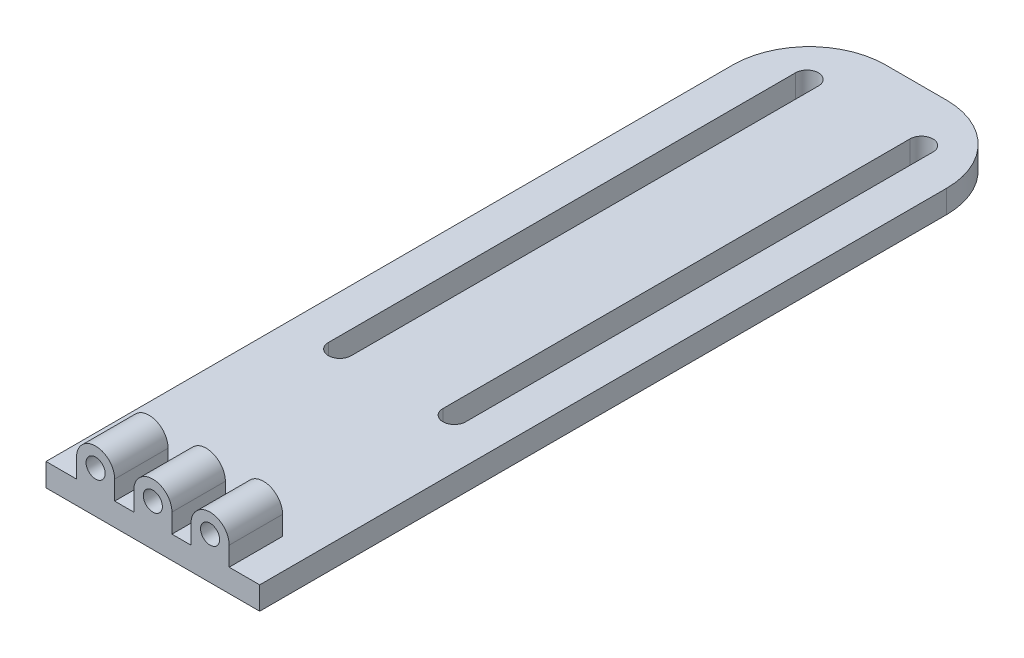
ISO-10303-21;
HEADER;
FILE_DESCRIPTION(('STEP AP214'),'2;1');
FILE_NAME('part.step','',(''),(''),'','','');
FILE_SCHEMA(('AUTOMOTIVE_DESIGN { 1 0 10303 214 1 1 1 1 }'));
ENDSEC;
DATA;
#1=APPLICATION_CONTEXT('core data for automotive mechanical design processes');
#2=APPLICATION_PROTOCOL_DEFINITION('international standard','automotive_design',2000,#1);
#3=PRODUCT_CONTEXT('',#1,'mechanical');
#4=PRODUCT('Part','Part','',(#3));
#5=PRODUCT_RELATED_PRODUCT_CATEGORY('part','',(#4));
#6=PRODUCT_DEFINITION_FORMATION('','',#4);
#7=PRODUCT_DEFINITION_CONTEXT('part definition',#1,'design');
#8=PRODUCT_DEFINITION('design','',#6,#7);
#9=PRODUCT_DEFINITION_SHAPE('','',#8);
#10=(LENGTH_UNIT() NAMED_UNIT(*) SI_UNIT(.MILLI.,.METRE.));
#11=(NAMED_UNIT(*) PLANE_ANGLE_UNIT() SI_UNIT($,.RADIAN.));
#12=(NAMED_UNIT(*) SI_UNIT($,.STERADIAN.) SOLID_ANGLE_UNIT());
#13=UNCERTAINTY_MEASURE_WITH_UNIT(LENGTH_MEASURE(1.E-05),#10,'distance_accuracy_value','');
#14=(GEOMETRIC_REPRESENTATION_CONTEXT(3) GLOBAL_UNCERTAINTY_ASSIGNED_CONTEXT((#13)) GLOBAL_UNIT_ASSIGNED_CONTEXT((#10,
#11,#12)) REPRESENTATION_CONTEXT('',''));
#15=CARTESIAN_POINT('',(0.,0.,0.));
#16=DIRECTION('',(0.,0.,1.));
#17=DIRECTION('',(1.,0.,0.));
#18=AXIS2_PLACEMENT_3D('',#15,#16,#17);
#19=CARTESIAN_POINT('',(-14.,3.,0.));
#20=DIRECTION('',(0.,0.,-1.));
#21=DIRECTION('',(-1.,0.,0.));
#22=AXIS2_PLACEMENT_3D('',#19,#20,#21);
#23=PLANE('',#22);
#24=CARTESIAN_POINT('',(-7.5,5.5,0.));
#25=DIRECTION('',(0.,0.,1.));
#26=DIRECTION('',(1.,0.,0.));
#27=AXIS2_PLACEMENT_3D('',#24,#25,#26);
#28=CIRCLE('',#27,1.25);
#29=CARTESIAN_POINT('',(-6.25,5.5,0.));
#30=VERTEX_POINT('',#29);
#31=EDGE_CURVE('E352',#30,#30,#28,.T.);
#32=ORIENTED_EDGE('',*,*,#31,.F.);
#33=EDGE_LOOP('',(#32));
#34=FACE_BOUND('',#33,.T.);
#35=CARTESIAN_POINT('',(0.,5.5,0.));
#36=DIRECTION('',(0.,0.,1.));
#37=DIRECTION('',(1.,0.,0.));
#38=AXIS2_PLACEMENT_3D('',#35,#36,#37);
#39=CIRCLE('',#38,1.25);
#40=CARTESIAN_POINT('',(1.25,5.5,0.));
#41=VERTEX_POINT('',#40);
#42=EDGE_CURVE('E360',#41,#41,#39,.T.);
#43=ORIENTED_EDGE('',*,*,#42,.F.);
#44=EDGE_LOOP('',(#43));
#45=FACE_BOUND('',#44,.T.);
#46=CARTESIAN_POINT('',(7.5,5.5,0.));
#47=DIRECTION('',(0.,0.,1.));
#48=DIRECTION('',(1.,0.,0.));
#49=AXIS2_PLACEMENT_3D('',#46,#47,#48);
#50=CIRCLE('',#49,1.25);
#51=CARTESIAN_POINT('',(8.75,5.5,0.));
#52=VERTEX_POINT('',#51);
#53=EDGE_CURVE('E330',#52,#52,#50,.T.);
#54=ORIENTED_EDGE('',*,*,#53,.F.);
#55=EDGE_LOOP('',(#54));
#56=FACE_BOUND('',#55,.T.);
#57=CARTESIAN_POINT('',(-7.5,5.5,0.));
#58=DIRECTION('',(0.,0.,-1.));
#59=DIRECTION('',(1.,0.,0.));
#60=AXIS2_PLACEMENT_3D('',#57,#58,#59);
#61=CIRCLE('',#60,2.5);
#62=CARTESIAN_POINT('',(-10.,5.5,0.));
#63=VERTEX_POINT('',#62);
#64=CARTESIAN_POINT('',(-5.,5.5,0.));
#65=VERTEX_POINT('',#64);
#66=EDGE_CURVE('E313',#63,#65,#61,.T.);
#67=ORIENTED_EDGE('',*,*,#66,.F.);
#68=DIRECTION('',(0.,1.,0.));
#69=VECTOR('',#68,1.);
#70=CARTESIAN_POINT('',(-10.,5.5,0.));
#71=LINE('',#70,#69);
#72=CARTESIAN_POINT('',(-10.,3.,0.));
#73=VERTEX_POINT('',#72);
#74=EDGE_CURVE('E268',#73,#63,#71,.T.);
#75=ORIENTED_EDGE('',*,*,#74,.F.);
#76=DIRECTION('',(1.,0.,0.));
#77=VECTOR('',#76,1.);
#78=CARTESIAN_POINT('',(-10.,3.,0.));
#79=LINE('',#78,#77);
#80=CARTESIAN_POINT('',(-14.,3.,0.));
#81=VERTEX_POINT('',#80);
#82=EDGE_CURVE('E264',#81,#73,#79,.T.);
#83=ORIENTED_EDGE('',*,*,#82,.F.);
#84=DIRECTION('',(0.,-1.,0.));
#85=VECTOR('',#84,1.);
#86=CARTESIAN_POINT('',(-14.,3.,0.));
#87=LINE('',#86,#85);
#88=CARTESIAN_POINT('',(-14.,0.,0.));
#89=VERTEX_POINT('',#88);
#90=EDGE_CURVE('E391',#81,#89,#87,.T.);
#91=ORIENTED_EDGE('',*,*,#90,.T.);
#92=DIRECTION('',(1.,0.,0.));
#93=VECTOR('',#92,1.);
#94=CARTESIAN_POINT('',(-14.,0.,0.));
#95=LINE('',#94,#93);
#96=CARTESIAN_POINT('',(14.,0.,0.));
#97=VERTEX_POINT('',#96);
#98=EDGE_CURVE('E377',#89,#97,#95,.T.);
#99=ORIENTED_EDGE('',*,*,#98,.T.);
#100=DIRECTION('',(0.,-1.,0.));
#101=VECTOR('',#100,1.);
#102=CARTESIAN_POINT('',(14.,3.,0.));
#103=LINE('',#102,#101);
#104=CARTESIAN_POINT('',(14.,3.,0.));
#105=VERTEX_POINT('',#104);
#106=EDGE_CURVE('E381',#105,#97,#103,.T.);
#107=ORIENTED_EDGE('',*,*,#106,.F.);
#108=DIRECTION('',(1.,0.,0.));
#109=VECTOR('',#108,1.);
#110=CARTESIAN_POINT('',(14.,3.,0.));
#111=LINE('',#110,#109);
#112=CARTESIAN_POINT('',(10.,3.,0.));
#113=VERTEX_POINT('',#112);
#114=EDGE_CURVE('E338',#113,#105,#111,.T.);
#115=ORIENTED_EDGE('',*,*,#114,.F.);
#116=DIRECTION('',(0.,-1.,0.));
#117=VECTOR('',#116,1.);
#118=CARTESIAN_POINT('',(10.,3.,0.));
#119=LINE('',#118,#117);
#120=CARTESIAN_POINT('',(10.,5.5,0.));
#121=VERTEX_POINT('',#120);
#122=EDGE_CURVE('E342',#121,#113,#119,.T.);
#123=ORIENTED_EDGE('',*,*,#122,.F.);
#124=CARTESIAN_POINT('',(7.5,5.5,0.));
#125=DIRECTION('',(0.,0.,-1.));
#126=DIRECTION('',(1.,0.,0.));
#127=AXIS2_PLACEMENT_3D('',#124,#125,#126);
#128=CIRCLE('',#127,2.5);
#129=CARTESIAN_POINT('',(5.,5.5,0.));
#130=VERTEX_POINT('',#129);
#131=EDGE_CURVE('E345',#130,#121,#128,.T.);
#132=ORIENTED_EDGE('',*,*,#131,.F.);
#133=DIRECTION('',(0.,1.,0.));
#134=VECTOR('',#133,1.);
#135=CARTESIAN_POINT('',(5.,5.5,0.));
#136=LINE('',#135,#134);
#137=CARTESIAN_POINT('',(5.,3.,0.));
#138=VERTEX_POINT('',#137);
#139=EDGE_CURVE('E280',#138,#130,#136,.T.);
#140=ORIENTED_EDGE('',*,*,#139,.F.);
#141=DIRECTION('',(1.,0.,0.));
#142=VECTOR('',#141,1.);
#143=CARTESIAN_POINT('',(5.,3.,0.));
#144=LINE('',#143,#142);
#145=CARTESIAN_POINT('',(2.5,3.,0.));
#146=VERTEX_POINT('',#145);
#147=EDGE_CURVE('E290',#146,#138,#144,.T.);
#148=ORIENTED_EDGE('',*,*,#147,.F.);
#149=DIRECTION('',(0.,-1.,0.));
#150=VECTOR('',#149,1.);
#151=CARTESIAN_POINT('',(2.5,3.,0.));
#152=LINE('',#151,#150);
#153=CARTESIAN_POINT('',(2.5,5.5,0.));
#154=VERTEX_POINT('',#153);
#155=EDGE_CURVE('E293',#154,#146,#152,.T.);
#156=ORIENTED_EDGE('',*,*,#155,.F.);
#157=CARTESIAN_POINT('',(0.,5.5,0.));
#158=DIRECTION('',(0.,0.,-1.));
#159=DIRECTION('',(1.,0.,0.));
#160=AXIS2_PLACEMENT_3D('',#157,#158,#159);
#161=CIRCLE('',#160,2.5);
#162=CARTESIAN_POINT('',(-2.5,5.5,0.));
#163=VERTEX_POINT('',#162);
#164=EDGE_CURVE('E325',#163,#154,#161,.T.);
#165=ORIENTED_EDGE('',*,*,#164,.F.);
#166=DIRECTION('',(0.,1.,0.));
#167=VECTOR('',#166,1.);
#168=CARTESIAN_POINT('',(-2.5,5.5,0.));
#169=LINE('',#168,#167);
#170=CARTESIAN_POINT('',(-2.5,3.,0.));
#171=VERTEX_POINT('',#170);
#172=EDGE_CURVE('E322',#171,#163,#169,.T.);
#173=ORIENTED_EDGE('',*,*,#172,.F.);
#174=DIRECTION('',(1.,0.,0.));
#175=VECTOR('',#174,1.);
#176=CARTESIAN_POINT('',(-5.,3.,0.));
#177=LINE('',#176,#175);
#178=CARTESIAN_POINT('',(-5.,3.,0.));
#179=VERTEX_POINT('',#178);
#180=EDGE_CURVE('E319',#179,#171,#177,.T.);
#181=ORIENTED_EDGE('',*,*,#180,.F.);
#182=DIRECTION('',(0.,-1.,0.));
#183=VECTOR('',#182,1.);
#184=CARTESIAN_POINT('',(-5.,3.,0.));
#185=LINE('',#184,#183);
#186=EDGE_CURVE('E316',#65,#179,#185,.T.);
#187=ORIENTED_EDGE('',*,*,#186,.F.);
#188=EDGE_LOOP('',(#67,#75,#83,#91,#99,#107,#115,#123,#132,#140,#148,#156,#165,#173,#181,#187));
#189=FACE_BOUND('',#188,.T.);
#190=ADVANCED_FACE('F32',(#34,#45,#56,#189),#23,.F.);
#191=CARTESIAN_POINT('',(-14.,8.,-7.));
#192=DIRECTION('',(0.,0.,1.));
#193=DIRECTION('',(1.,0.,0.));
#194=AXIS2_PLACEMENT_3D('',#191,#192,#193);
#195=PLANE('',#194);
#196=CARTESIAN_POINT('',(0.,5.5,-7.00000000000001));
#197=DIRECTION('',(0.,0.,1.));
#198=DIRECTION('',(1.,0.,0.));
#199=AXIS2_PLACEMENT_3D('',#196,#197,#198);
#200=CIRCLE('',#199,1.25);
#201=CARTESIAN_POINT('',(1.25,5.5,-7.00000000000001));
#202=VERTEX_POINT('',#201);
#203=EDGE_CURVE('E356',#202,#202,#200,.F.);
#204=ORIENTED_EDGE('',*,*,#203,.F.);
#205=EDGE_LOOP('',(#204));
#206=FACE_BOUND('',#205,.T.);
#207=CARTESIAN_POINT('',(0.,5.5,-7.00000000000001));
#208=DIRECTION('',(0.,0.,1.));
#209=DIRECTION('',(1.,0.,0.));
#210=AXIS2_PLACEMENT_3D('',#207,#208,#209);
#211=CIRCLE('',#210,2.5);
#212=CARTESIAN_POINT('',(2.5,5.5,-7.00000000000001));
#213=VERTEX_POINT('',#212);
#214=CARTESIAN_POINT('',(-2.5,5.5,-7.00000000000001));
#215=VERTEX_POINT('',#214);
#216=EDGE_CURVE('E310',#213,#215,#211,.T.);
#217=ORIENTED_EDGE('',*,*,#216,.F.);
#218=DIRECTION('',(0.,1.,0.));
#219=VECTOR('',#218,1.);
#220=CARTESIAN_POINT('',(2.5,3.,-7.00000000000001));
#221=LINE('',#220,#219);
#222=CARTESIAN_POINT('',(2.5,3.,-7.00000000000001));
#223=VERTEX_POINT('',#222);
#224=EDGE_CURVE('E296',#223,#213,#221,.T.);
#225=ORIENTED_EDGE('',*,*,#224,.F.);
#226=DIRECTION('',(-1.,0.,0.));
#227=VECTOR('',#226,1.);
#228=CARTESIAN_POINT('',(-14.,3.,-7.));
#229=LINE('',#228,#227);
#230=CARTESIAN_POINT('',(-2.5,3.,-7.00000000000001));
#231=VERTEX_POINT('',#230);
#232=EDGE_CURVE('E372',#223,#231,#229,.T.);
#233=ORIENTED_EDGE('',*,*,#232,.T.);
#234=DIRECTION('',(0.,-1.,0.));
#235=VECTOR('',#234,1.);
#236=CARTESIAN_POINT('',(-2.5,5.5,-7.00000000000001));
#237=LINE('',#236,#235);
#238=EDGE_CURVE('E307',#215,#231,#237,.T.);
#239=ORIENTED_EDGE('',*,*,#238,.F.);
#240=EDGE_LOOP('',(#217,#225,#233,#239));
#241=FACE_BOUND('',#240,.T.);
#242=ADVANCED_FACE('F469',(#206,#241),#195,.F.);
#243=CARTESIAN_POINT('',(7.5,5.5,-7.00000000000001));
#244=DIRECTION('',(0.,0.,1.));
#245=DIRECTION('',(1.,0.,0.));
#246=AXIS2_PLACEMENT_3D('',#243,#244,#245);
#247=CIRCLE('',#246,1.25);
#248=CARTESIAN_POINT('',(8.75,5.5,-7.00000000000001));
#249=VERTEX_POINT('',#248);
#250=EDGE_CURVE('E363',#249,#249,#247,.F.);
#251=ORIENTED_EDGE('',*,*,#250,.F.);
#252=EDGE_LOOP('',(#251));
#253=FACE_BOUND('',#252,.T.);
#254=CARTESIAN_POINT('',(10.,3.,-7.00000000000001));
#255=VERTEX_POINT('',#254);
#256=CARTESIAN_POINT('',(5.,3.,-7.00000000000001));
#257=VERTEX_POINT('',#256);
#258=EDGE_CURVE('E373',#255,#257,#229,.T.);
#259=ORIENTED_EDGE('',*,*,#258,.T.);
#260=DIRECTION('',(0.,-1.,0.));
#261=VECTOR('',#260,1.);
#262=CARTESIAN_POINT('',(5.,5.5,-7.00000000000001));
#263=LINE('',#262,#261);
#264=CARTESIAN_POINT('',(5.,5.5,-7.00000000000001));
#265=VERTEX_POINT('',#264);
#266=EDGE_CURVE('E271',#265,#257,#263,.T.);
#267=ORIENTED_EDGE('',*,*,#266,.F.);
#268=CARTESIAN_POINT('',(7.5,5.5,-7.00000000000001));
#269=DIRECTION('',(0.,0.,1.));
#270=DIRECTION('',(1.,0.,0.));
#271=AXIS2_PLACEMENT_3D('',#268,#269,#270);
#272=CIRCLE('',#271,2.5);
#273=CARTESIAN_POINT('',(10.,5.5,-7.00000000000001));
#274=VERTEX_POINT('',#273);
#275=EDGE_CURVE('E348',#274,#265,#272,.T.);
#276=ORIENTED_EDGE('',*,*,#275,.F.);
#277=DIRECTION('',(0.,1.,0.));
#278=VECTOR('',#277,1.);
#279=CARTESIAN_POINT('',(10.,3.,-7.00000000000001));
#280=LINE('',#279,#278);
#281=EDGE_CURVE('E287',#255,#274,#280,.T.);
#282=ORIENTED_EDGE('',*,*,#281,.F.);
#283=EDGE_LOOP('',(#259,#267,#276,#282));
#284=FACE_BOUND('',#283,.T.);
#285=ADVANCED_FACE('F477',(#253,#284),#195,.F.);
#286=CARTESIAN_POINT('',(-7.5,5.5,-7.00000000000001));
#287=DIRECTION('',(0.,0.,1.));
#288=DIRECTION('',(1.,0.,0.));
#289=AXIS2_PLACEMENT_3D('',#286,#287,#288);
#290=CIRCLE('',#289,1.25);
#291=CARTESIAN_POINT('',(-6.25,5.5,-7.00000000000001));
#292=VERTEX_POINT('',#291);
#293=EDGE_CURVE('E355',#292,#292,#290,.F.);
#294=ORIENTED_EDGE('',*,*,#293,.F.);
#295=EDGE_LOOP('',(#294));
#296=FACE_BOUND('',#295,.T.);
#297=DIRECTION('',(0.,-1.,0.));
#298=VECTOR('',#297,1.);
#299=CARTESIAN_POINT('',(-10.,5.5,-7.00000000000001));
#300=LINE('',#299,#298);
#301=CARTESIAN_POINT('',(-10.,5.5,-7.00000000000001));
#302=VERTEX_POINT('',#301);
#303=CARTESIAN_POINT('',(-10.,3.,-7.00000000000001));
#304=VERTEX_POINT('',#303);
#305=EDGE_CURVE('E239',#302,#304,#300,.T.);
#306=ORIENTED_EDGE('',*,*,#305,.F.);
#307=CARTESIAN_POINT('',(-7.5,5.5,-7.00000000000001));
#308=DIRECTION('',(0.,0.,1.));
#309=DIRECTION('',(1.,0.,0.));
#310=AXIS2_PLACEMENT_3D('',#307,#308,#309);
#311=CIRCLE('',#310,2.5);
#312=CARTESIAN_POINT('',(-5.,5.5,-7.00000000000001));
#313=VERTEX_POINT('',#312);
#314=EDGE_CURVE('E301',#313,#302,#311,.T.);
#315=ORIENTED_EDGE('',*,*,#314,.F.);
#316=DIRECTION('',(0.,1.,0.));
#317=VECTOR('',#316,1.);
#318=CARTESIAN_POINT('',(-5.,3.,-7.00000000000001));
#319=LINE('',#318,#317);
#320=CARTESIAN_POINT('',(-5.,3.,-7.00000000000001));
#321=VERTEX_POINT('',#320);
#322=EDGE_CURVE('E303',#321,#313,#319,.T.);
#323=ORIENTED_EDGE('',*,*,#322,.F.);
#324=EDGE_CURVE('E359',#321,#304,#229,.T.);
#325=ORIENTED_EDGE('',*,*,#324,.T.);
#326=EDGE_LOOP('',(#306,#315,#323,#325));
#327=FACE_BOUND('',#326,.T.);
#328=ADVANCED_FACE('F455',(#296,#327),#195,.F.);
#329=CARTESIAN_POINT('',(0.,3.,0.));
#330=DIRECTION('',(0.,-1.,0.));
#331=DIRECTION('',(0.,0.,-1.));
#332=AXIS2_PLACEMENT_3D('',#329,#330,#331);
#333=PLANE('',#332);
#334=DIRECTION('',(0.,0.,-1.));
#335=VECTOR('',#334,1.);
#336=CARTESIAN_POINT('',(-5.99999999999999,3.,-32.0000000000107));
#337=LINE('',#336,#335);
#338=CARTESIAN_POINT('',(-5.99999999999999,3.,-32.0000000000107));
#339=VERTEX_POINT('',#338);
#340=CARTESIAN_POINT('',(-5.99999999999999,3.,-93.208471880839));
#341=VERTEX_POINT('',#340);
#342=EDGE_CURVE('E222',#339,#341,#337,.T.);
#343=ORIENTED_EDGE('',*,*,#342,.F.);
#344=CARTESIAN_POINT('',(-7.49999999999999,3.,-32.0000000000107));
#345=DIRECTION('',(0.,1.,0.));
#346=DIRECTION('',(0.,0.,1.));
#347=AXIS2_PLACEMENT_3D('',#344,#345,#346);
#348=CIRCLE('',#347,1.5);
#349=CARTESIAN_POINT('',(-8.99999999999999,3.,-32.0000000000107));
#350=VERTEX_POINT('',#349);
#351=EDGE_CURVE('E227',#350,#339,#348,.T.);
#352=ORIENTED_EDGE('',*,*,#351,.F.);
#353=DIRECTION('',(0.,0.,1.));
#354=VECTOR('',#353,1.);
#355=CARTESIAN_POINT('',(-8.99999999999999,3.,-32.0000000000107));
#356=LINE('',#355,#354);
#357=CARTESIAN_POINT('',(-8.99999999999999,3.,-93.208471880839));
#358=VERTEX_POINT('',#357);
#359=EDGE_CURVE('E232',#358,#350,#356,.T.);
#360=ORIENTED_EDGE('',*,*,#359,.F.);
#361=CARTESIAN_POINT('',(-7.49999999999999,3.,-93.208471880839));
#362=DIRECTION('',(0.,1.,0.));
#363=DIRECTION('',(0.,0.,1.));
#364=AXIS2_PLACEMENT_3D('',#361,#362,#363);
#365=CIRCLE('',#364,1.5);
#366=EDGE_CURVE('E211',#341,#358,#365,.T.);
#367=ORIENTED_EDGE('',*,*,#366,.F.);
#368=EDGE_LOOP('',(#343,#352,#360,#367));
#369=FACE_BOUND('',#368,.T.);
#370=DIRECTION('',(0.,0.,-1.));
#371=VECTOR('',#370,1.);
#372=CARTESIAN_POINT('',(8.99999999999999,3.,-32.0000000000107));
#373=LINE('',#372,#371);
#374=CARTESIAN_POINT('',(8.99999999999999,3.,-32.0000000000107));
#375=VERTEX_POINT('',#374);
#376=CARTESIAN_POINT('',(8.99999999999999,3.,-93.208471880839));
#377=VERTEX_POINT('',#376);
#378=EDGE_CURVE('E244',#375,#377,#373,.T.);
#379=ORIENTED_EDGE('',*,*,#378,.F.);
#380=CARTESIAN_POINT('',(7.49999999999999,3.,-32.0000000000107));
#381=DIRECTION('',(0.,1.,0.));
#382=DIRECTION('',(0.,0.,-1.));
#383=AXIS2_PLACEMENT_3D('',#380,#381,#382);
#384=CIRCLE('',#383,1.5);
#385=CARTESIAN_POINT('',(5.99999999999999,3.,-32.0000000000107));
#386=VERTEX_POINT('',#385);
#387=EDGE_CURVE('E242',#386,#375,#384,.T.);
#388=ORIENTED_EDGE('',*,*,#387,.F.);
#389=DIRECTION('',(0.,0.,1.));
#390=VECTOR('',#389,1.);
#391=CARTESIAN_POINT('',(5.99999999999999,3.,-32.0000000000107));
#392=LINE('',#391,#390);
#393=CARTESIAN_POINT('',(5.99999999999999,3.,-93.208471880839));
#394=VERTEX_POINT('',#393);
#395=EDGE_CURVE('E250',#394,#386,#392,.T.);
#396=ORIENTED_EDGE('',*,*,#395,.F.);
#397=CARTESIAN_POINT('',(7.49999999999999,3.,-93.208471880839));
#398=DIRECTION('',(0.,1.,0.));
#399=DIRECTION('',(0.,0.,-1.));
#400=AXIS2_PLACEMENT_3D('',#397,#398,#399);
#401=CIRCLE('',#400,1.5);
#402=EDGE_CURVE('E247',#377,#394,#401,.T.);
#403=ORIENTED_EDGE('',*,*,#402,.F.);
#404=EDGE_LOOP('',(#379,#388,#396,#403));
#405=FACE_BOUND('',#404,.T.);
#406=DIRECTION('',(-1.,0.,0.));
#407=VECTOR('',#406,1.);
#408=CARTESIAN_POINT('',(-14.,3.,-100.));
#409=LINE('',#408,#407);
#410=CARTESIAN_POINT('',(4.,3.,-100.));
#411=VERTEX_POINT('',#410);
#412=CARTESIAN_POINT('',(-4.,3.,-100.));
#413=VERTEX_POINT('',#412);
#414=EDGE_CURVE('E376',#411,#413,#409,.T.);
#415=ORIENTED_EDGE('',*,*,#414,.T.);
#416=CARTESIAN_POINT('',(-4.,3.,-90.));
#417=DIRECTION('',(0.,-1.,0.));
#418=DIRECTION('',(0.,0.,-1.));
#419=AXIS2_PLACEMENT_3D('',#416,#417,#418);
#420=CIRCLE('',#419,10.);
#421=CARTESIAN_POINT('',(-14.,3.,-90.));
#422=VERTEX_POINT('',#421);
#423=EDGE_CURVE('E40',#413,#422,#420,.F.);
#424=ORIENTED_EDGE('',*,*,#423,.T.);
#425=DIRECTION('',(0.,0.,1.));
#426=VECTOR('',#425,1.);
#427=CARTESIAN_POINT('',(-14.,3.,0.));
#428=LINE('',#427,#426);
#429=EDGE_CURVE('E379',#422,#81,#428,.T.);
#430=ORIENTED_EDGE('',*,*,#429,.T.);
#431=ORIENTED_EDGE('',*,*,#82,.T.);
#432=DIRECTION('',(0.,0.,1.));
#433=VECTOR('',#432,1.);
#434=CARTESIAN_POINT('',(-10.,3.,-100.001));
#435=LINE('',#434,#433);
#436=EDGE_CURVE('E262',#304,#73,#435,.T.);
#437=ORIENTED_EDGE('',*,*,#436,.F.);
#438=ORIENTED_EDGE('',*,*,#324,.F.);
#439=DIRECTION('',(0.,0.,1.));
#440=VECTOR('',#439,1.);
#441=CARTESIAN_POINT('',(-5.,3.,-100.001));
#442=LINE('',#441,#440);
#443=EDGE_CURVE('E333',#321,#179,#442,.T.);
#444=ORIENTED_EDGE('',*,*,#443,.T.);
#445=ORIENTED_EDGE('',*,*,#180,.T.);
#446=DIRECTION('',(0.,0.,1.));
#447=VECTOR('',#446,1.);
#448=CARTESIAN_POINT('',(-2.5,3.,-100.001));
#449=LINE('',#448,#447);
#450=EDGE_CURVE('E331',#231,#171,#449,.T.);
#451=ORIENTED_EDGE('',*,*,#450,.F.);
#452=ORIENTED_EDGE('',*,*,#232,.F.);
#453=DIRECTION('',(0.,0.,1.));
#454=VECTOR('',#453,1.);
#455=CARTESIAN_POINT('',(2.5,3.,-100.001));
#456=LINE('',#455,#454);
#457=EDGE_CURVE('E279',#223,#146,#456,.T.);
#458=ORIENTED_EDGE('',*,*,#457,.T.);
#459=ORIENTED_EDGE('',*,*,#147,.T.);
#460=DIRECTION('',(0.,0.,1.));
#461=VECTOR('',#460,1.);
#462=CARTESIAN_POINT('',(5.,3.,-100.001));
#463=LINE('',#462,#461);
#464=EDGE_CURVE('E282',#257,#138,#463,.T.);
#465=ORIENTED_EDGE('',*,*,#464,.F.);
#466=ORIENTED_EDGE('',*,*,#258,.F.);
#467=DIRECTION('',(0.,0.,1.));
#468=VECTOR('',#467,1.);
#469=CARTESIAN_POINT('',(10.,3.,-100.001));
#470=LINE('',#469,#468);
#471=EDGE_CURVE('E304',#255,#113,#470,.T.);
#472=ORIENTED_EDGE('',*,*,#471,.T.);
#473=ORIENTED_EDGE('',*,*,#114,.T.);
#474=DIRECTION('',(0.,0.,-1.));
#475=VECTOR('',#474,1.);
#476=CARTESIAN_POINT('',(14.,3.,0.));
#477=LINE('',#476,#475);
#478=CARTESIAN_POINT('',(14.,3.,-90.));
#479=VERTEX_POINT('',#478);
#480=EDGE_CURVE('E374',#105,#479,#477,.T.);
#481=ORIENTED_EDGE('',*,*,#480,.T.);
#482=CARTESIAN_POINT('',(4.,3.,-90.));
#483=DIRECTION('',(0.,-1.,0.));
#484=DIRECTION('',(0.,0.,-1.));
#485=AXIS2_PLACEMENT_3D('',#482,#483,#484);
#486=CIRCLE('',#485,10.);
#487=EDGE_CURVE('E421',#479,#411,#486,.F.);
#488=ORIENTED_EDGE('',*,*,#487,.T.);
#489=EDGE_LOOP('',(#415,#424,#430,#431,#437,#438,#444,#445,#451,#452,#458,#459,#465,#466,#472,
#473,#481,#488));
#490=FACE_BOUND('',#489,.T.);
#491=ADVANCED_FACE('F229',(#369,#405,#490),#333,.F.);
#492=CARTESIAN_POINT('',(14.,3.,0.));
#493=DIRECTION('',(-1.,0.,0.));
#494=DIRECTION('',(0.,0.,1.));
#495=AXIS2_PLACEMENT_3D('',#492,#493,#494);
#496=PLANE('',#495);
#497=DIRECTION('',(0.,0.,-1.));
#498=VECTOR('',#497,1.);
#499=CARTESIAN_POINT('',(14.,0.,0.));
#500=LINE('',#499,#498);
#501=CARTESIAN_POINT('',(14.,0.,-90.));
#502=VERTEX_POINT('',#501);
#503=EDGE_CURVE('E382',#97,#502,#500,.T.);
#504=ORIENTED_EDGE('',*,*,#503,.T.);
#505=DIRECTION('',(0.,-1.,0.));
#506=VECTOR('',#505,1.);
#507=CARTESIAN_POINT('',(14.,3.,-90.));
#508=LINE('',#507,#506);
#509=EDGE_CURVE('E11',#502,#479,#508,.F.);
#510=ORIENTED_EDGE('',*,*,#509,.T.);
#511=ORIENTED_EDGE('',*,*,#480,.F.);
#512=ORIENTED_EDGE('',*,*,#106,.T.);
#513=EDGE_LOOP('',(#504,#510,#511,#512));
#514=FACE_BOUND('',#513,.T.);
#515=ADVANCED_FACE('F442',(#514),#496,.F.);
#516=CARTESIAN_POINT('',(-14.,3.,-100.));
#517=DIRECTION('',(0.,0.,1.));
#518=DIRECTION('',(1.,0.,0.));
#519=AXIS2_PLACEMENT_3D('',#516,#517,#518);
#520=PLANE('',#519);
#521=DIRECTION('',(-1.,0.,0.));
#522=VECTOR('',#521,1.);
#523=CARTESIAN_POINT('',(-14.,0.,-100.));
#524=LINE('',#523,#522);
#525=CARTESIAN_POINT('',(4.,0.,-100.));
#526=VERTEX_POINT('',#525);
#527=CARTESIAN_POINT('',(-4.,0.,-100.));
#528=VERTEX_POINT('',#527);
#529=EDGE_CURVE('E384',#526,#528,#524,.T.);
#530=ORIENTED_EDGE('',*,*,#529,.T.);
#531=DIRECTION('',(0.,-1.,0.));
#532=VECTOR('',#531,1.);
#533=CARTESIAN_POINT('',(-4.,3.,-100.));
#534=LINE('',#533,#532);
#535=EDGE_CURVE('E53',#528,#413,#534,.F.);
#536=ORIENTED_EDGE('',*,*,#535,.T.);
#537=ORIENTED_EDGE('',*,*,#414,.F.);
#538=DIRECTION('',(0.,-1.,0.));
#539=VECTOR('',#538,1.);
#540=CARTESIAN_POINT('',(4.,3.,-100.));
#541=LINE('',#540,#539);
#542=EDGE_CURVE('E417',#411,#526,#541,.T.);
#543=ORIENTED_EDGE('',*,*,#542,.T.);
#544=EDGE_LOOP('',(#530,#536,#537,#543));
#545=FACE_BOUND('',#544,.T.);
#546=ADVANCED_FACE('F437',(#545),#520,.F.);
#547=CARTESIAN_POINT('',(-14.,3.,0.));
#548=DIRECTION('',(1.,0.,0.));
#549=DIRECTION('',(0.,0.,-1.));
#550=AXIS2_PLACEMENT_3D('',#547,#548,#549);
#551=PLANE('',#550);
#552=ORIENTED_EDGE('',*,*,#429,.F.);
#553=DIRECTION('',(0.,-1.,0.));
#554=VECTOR('',#553,1.);
#555=CARTESIAN_POINT('',(-14.,3.,-90.));
#556=LINE('',#555,#554);
#557=CARTESIAN_POINT('',(-14.,0.,-90.));
#558=VERTEX_POINT('',#557);
#559=EDGE_CURVE('E410',#422,#558,#556,.T.);
#560=ORIENTED_EDGE('',*,*,#559,.T.);
#561=DIRECTION('',(0.,0.,1.));
#562=VECTOR('',#561,1.);
#563=CARTESIAN_POINT('',(-14.,0.,0.));
#564=LINE('',#563,#562);
#565=EDGE_CURVE('E386',#558,#89,#564,.T.);
#566=ORIENTED_EDGE('',*,*,#565,.T.);
#567=ORIENTED_EDGE('',*,*,#90,.F.);
#568=EDGE_LOOP('',(#552,#560,#566,#567));
#569=FACE_BOUND('',#568,.T.);
#570=ADVANCED_FACE('F430',(#569),#551,.F.);
#571=CARTESIAN_POINT('',(0.,0.,0.));
#572=DIRECTION('',(0.,-1.,0.));
#573=DIRECTION('',(0.,0.,-1.));
#574=AXIS2_PLACEMENT_3D('',#571,#572,#573);
#575=PLANE('',#574);
#576=CARTESIAN_POINT('',(-7.49999999999999,0.,-32.0000000000107));
#577=DIRECTION('',(0.,-1.,0.));
#578=DIRECTION('',(0.,0.,-1.));
#579=AXIS2_PLACEMENT_3D('',#576,#577,#578);
#580=CIRCLE('',#579,1.5);
#581=CARTESIAN_POINT('',(-5.99999999999999,0.,-32.0000000000107));
#582=VERTEX_POINT('',#581);
#583=CARTESIAN_POINT('',(-8.99999999999999,0.,-32.0000000000107));
#584=VERTEX_POINT('',#583);
#585=EDGE_CURVE('E408',#582,#584,#580,.T.);
#586=ORIENTED_EDGE('',*,*,#585,.F.);
#587=DIRECTION('',(0.,0.,1.));
#588=VECTOR('',#587,1.);
#589=CARTESIAN_POINT('',(-5.99999999999999,0.,0.));
#590=LINE('',#589,#588);
#591=CARTESIAN_POINT('',(-6.,0.,-93.208471880839));
#592=VERTEX_POINT('',#591);
#593=EDGE_CURVE('E403',#592,#582,#590,.T.);
#594=ORIENTED_EDGE('',*,*,#593,.F.);
#595=CARTESIAN_POINT('',(-7.49999999999999,0.,-93.208471880839));
#596=DIRECTION('',(0.,-1.,0.));
#597=DIRECTION('',(0.,0.,-1.));
#598=AXIS2_PLACEMENT_3D('',#595,#596,#597);
#599=CIRCLE('',#598,1.5);
#600=CARTESIAN_POINT('',(-8.99999999999999,0.,-93.208471880839));
#601=VERTEX_POINT('',#600);
#602=EDGE_CURVE('E214',#601,#592,#599,.T.);
#603=ORIENTED_EDGE('',*,*,#602,.F.);
#604=DIRECTION('',(0.,0.,-1.));
#605=VECTOR('',#604,1.);
#606=CARTESIAN_POINT('',(-8.99999999999999,0.,0.));
#607=LINE('',#606,#605);
#608=EDGE_CURVE('E406',#584,#601,#607,.T.);
#609=ORIENTED_EDGE('',*,*,#608,.F.);
#610=EDGE_LOOP('',(#586,#594,#603,#609));
#611=FACE_BOUND('',#610,.T.);
#612=CARTESIAN_POINT('',(7.49999999999999,0.,-32.0000000000107));
#613=DIRECTION('',(0.,-1.,0.));
#614=DIRECTION('',(0.,0.,-1.));
#615=AXIS2_PLACEMENT_3D('',#612,#613,#614);
#616=CIRCLE('',#615,1.5);
#617=CARTESIAN_POINT('',(8.99999999999999,0.,-32.0000000000107));
#618=VERTEX_POINT('',#617);
#619=CARTESIAN_POINT('',(5.99999999999999,0.,-32.0000000000107));
#620=VERTEX_POINT('',#619);
#621=EDGE_CURVE('E401',#618,#620,#616,.T.);
#622=ORIENTED_EDGE('',*,*,#621,.F.);
#623=DIRECTION('',(0.,0.,1.));
#624=VECTOR('',#623,1.);
#625=CARTESIAN_POINT('',(8.99999999999999,0.,0.));
#626=LINE('',#625,#624);
#627=CARTESIAN_POINT('',(8.99999999999999,0.,-93.208471880839));
#628=VERTEX_POINT('',#627);
#629=EDGE_CURVE('E394',#628,#618,#626,.T.);
#630=ORIENTED_EDGE('',*,*,#629,.F.);
#631=CARTESIAN_POINT('',(7.49999999999999,0.,-93.208471880839));
#632=DIRECTION('',(0.,-1.,0.));
#633=DIRECTION('',(0.,0.,-1.));
#634=AXIS2_PLACEMENT_3D('',#631,#632,#633);
#635=CIRCLE('',#634,1.5);
#636=CARTESIAN_POINT('',(5.99999999999999,0.,-93.208471880839));
#637=VERTEX_POINT('',#636);
#638=EDGE_CURVE('E396',#637,#628,#635,.T.);
#639=ORIENTED_EDGE('',*,*,#638,.F.);
#640=DIRECTION('',(0.,0.,-1.));
#641=VECTOR('',#640,1.);
#642=CARTESIAN_POINT('',(5.99999999999999,0.,0.));
#643=LINE('',#642,#641);
#644=EDGE_CURVE('E399',#620,#637,#643,.T.);
#645=ORIENTED_EDGE('',*,*,#644,.F.);
#646=EDGE_LOOP('',(#622,#630,#639,#645));
#647=FACE_BOUND('',#646,.T.);
#648=ORIENTED_EDGE('',*,*,#565,.F.);
#649=CARTESIAN_POINT('',(-4.,0.,-90.));
#650=DIRECTION('',(0.,-1.,0.));
#651=DIRECTION('',(0.,0.,-1.));
#652=AXIS2_PLACEMENT_3D('',#649,#650,#651);
#653=CIRCLE('',#652,10.);
#654=EDGE_CURVE('E415',#558,#528,#653,.T.);
#655=ORIENTED_EDGE('',*,*,#654,.T.);
#656=ORIENTED_EDGE('',*,*,#529,.F.);
#657=CARTESIAN_POINT('',(4.,0.,-90.));
#658=DIRECTION('',(0.,-1.,0.));
#659=DIRECTION('',(0.,0.,-1.));
#660=AXIS2_PLACEMENT_3D('',#657,#658,#659);
#661=CIRCLE('',#660,10.);
#662=EDGE_CURVE('E413',#526,#502,#661,.T.);
#663=ORIENTED_EDGE('',*,*,#662,.T.);
#664=ORIENTED_EDGE('',*,*,#503,.F.);
#665=ORIENTED_EDGE('',*,*,#98,.F.);
#666=EDGE_LOOP('',(#648,#655,#656,#663,#664,#665));
#667=FACE_BOUND('',#666,.T.);
#668=ADVANCED_FACE('F435',(#611,#647,#667),#575,.T.);
#669=CARTESIAN_POINT('',(7.5,5.5,-100.001));
#670=DIRECTION('',(0.,0.,1.));
#671=DIRECTION('',(1.,0.,0.));
#672=AXIS2_PLACEMENT_3D('',#669,#670,#671);
#673=CYLINDRICAL_SURFACE('',#672,1.25);
#674=ORIENTED_EDGE('',*,*,#53,.T.);
#675=EDGE_LOOP('',(#674));
#676=FACE_BOUND('',#675,.T.);
#677=ORIENTED_EDGE('',*,*,#250,.T.);
#678=EDGE_LOOP('',(#677));
#679=FACE_BOUND('',#678,.T.);
#680=ADVANCED_FACE('F638',(#676,#679),#673,.F.);
#681=CARTESIAN_POINT('',(0.,5.5,-100.001));
#682=DIRECTION('',(0.,0.,1.));
#683=DIRECTION('',(1.,0.,0.));
#684=AXIS2_PLACEMENT_3D('',#681,#682,#683);
#685=CYLINDRICAL_SURFACE('',#684,1.25);
#686=ORIENTED_EDGE('',*,*,#42,.T.);
#687=EDGE_LOOP('',(#686));
#688=FACE_BOUND('',#687,.T.);
#689=ORIENTED_EDGE('',*,*,#203,.T.);
#690=EDGE_LOOP('',(#689));
#691=FACE_BOUND('',#690,.T.);
#692=ADVANCED_FACE('F656',(#688,#691),#685,.F.);
#693=CARTESIAN_POINT('',(-7.5,5.5,-100.001));
#694=DIRECTION('',(0.,0.,1.));
#695=DIRECTION('',(1.,0.,0.));
#696=AXIS2_PLACEMENT_3D('',#693,#694,#695);
#697=CYLINDRICAL_SURFACE('',#696,1.25);
#698=ORIENTED_EDGE('',*,*,#31,.T.);
#699=EDGE_LOOP('',(#698));
#700=FACE_BOUND('',#699,.T.);
#701=ORIENTED_EDGE('',*,*,#293,.T.);
#702=EDGE_LOOP('',(#701));
#703=FACE_BOUND('',#702,.T.);
#704=ADVANCED_FACE('F663',(#700,#703),#697,.F.);
#705=CARTESIAN_POINT('',(7.5,5.5,-100.001));
#706=DIRECTION('',(0.,0.,1.));
#707=DIRECTION('',(1.,0.,0.));
#708=AXIS2_PLACEMENT_3D('',#705,#706,#707);
#709=CYLINDRICAL_SURFACE('',#708,2.5);
#710=ORIENTED_EDGE('',*,*,#275,.T.);
#711=DIRECTION('',(0.,0.,1.));
#712=VECTOR('',#711,1.);
#713=CARTESIAN_POINT('',(5.,5.5,-100.001));
#714=LINE('',#713,#712);
#715=EDGE_CURVE('E284',#265,#130,#714,.T.);
#716=ORIENTED_EDGE('',*,*,#715,.T.);
#717=ORIENTED_EDGE('',*,*,#131,.T.);
#718=DIRECTION('',(0.,0.,1.));
#719=VECTOR('',#718,1.);
#720=CARTESIAN_POINT('',(10.,5.5,-100.001));
#721=LINE('',#720,#719);
#722=EDGE_CURVE('E336',#274,#121,#721,.T.);
#723=ORIENTED_EDGE('',*,*,#722,.F.);
#724=EDGE_LOOP('',(#710,#716,#717,#723));
#725=FACE_BOUND('',#724,.T.);
#726=ADVANCED_FACE('F485',(#725),#709,.T.);
#727=CARTESIAN_POINT('',(10.,3.,-100.001));
#728=DIRECTION('',(-1.,0.,0.));
#729=DIRECTION('',(0.,0.,1.));
#730=AXIS2_PLACEMENT_3D('',#727,#728,#729);
#731=PLANE('',#730);
#732=ORIENTED_EDGE('',*,*,#281,.T.);
#733=ORIENTED_EDGE('',*,*,#722,.T.);
#734=ORIENTED_EDGE('',*,*,#122,.T.);
#735=ORIENTED_EDGE('',*,*,#471,.F.);
#736=EDGE_LOOP('',(#732,#733,#734,#735));
#737=FACE_BOUND('',#736,.T.);
#738=ADVANCED_FACE('F488',(#737),#731,.F.);
#739=CARTESIAN_POINT('',(-7.5,5.5,-100.001));
#740=DIRECTION('',(0.,0.,1.));
#741=DIRECTION('',(1.,0.,0.));
#742=AXIS2_PLACEMENT_3D('',#739,#740,#741);
#743=CYLINDRICAL_SURFACE('',#742,2.5);
#744=ORIENTED_EDGE('',*,*,#314,.T.);
#745=DIRECTION('',(0.,0.,1.));
#746=VECTOR('',#745,1.);
#747=CARTESIAN_POINT('',(-10.,5.5,-100.001));
#748=LINE('',#747,#746);
#749=EDGE_CURVE('E265',#302,#63,#748,.T.);
#750=ORIENTED_EDGE('',*,*,#749,.T.);
#751=ORIENTED_EDGE('',*,*,#66,.T.);
#752=DIRECTION('',(0.,0.,1.));
#753=VECTOR('',#752,1.);
#754=CARTESIAN_POINT('',(-5.,5.5,-100.001));
#755=LINE('',#754,#753);
#756=EDGE_CURVE('E327',#313,#65,#755,.T.);
#757=ORIENTED_EDGE('',*,*,#756,.F.);
#758=EDGE_LOOP('',(#744,#750,#751,#757));
#759=FACE_BOUND('',#758,.T.);
#760=ADVANCED_FACE('F685',(#759),#743,.T.);
#761=CARTESIAN_POINT('',(-5.,3.,-100.001));
#762=DIRECTION('',(-1.,0.,0.));
#763=DIRECTION('',(0.,0.,1.));
#764=AXIS2_PLACEMENT_3D('',#761,#762,#763);
#765=PLANE('',#764);
#766=ORIENTED_EDGE('',*,*,#322,.T.);
#767=ORIENTED_EDGE('',*,*,#756,.T.);
#768=ORIENTED_EDGE('',*,*,#186,.T.);
#769=ORIENTED_EDGE('',*,*,#443,.F.);
#770=EDGE_LOOP('',(#766,#767,#768,#769));
#771=FACE_BOUND('',#770,.T.);
#772=ADVANCED_FACE('F457',(#771),#765,.F.);
#773=CARTESIAN_POINT('',(-2.5,5.5,-100.001));
#774=DIRECTION('',(1.,0.,0.));
#775=DIRECTION('',(0.,0.,-1.));
#776=AXIS2_PLACEMENT_3D('',#773,#774,#775);
#777=PLANE('',#776);
#778=ORIENTED_EDGE('',*,*,#238,.T.);
#779=ORIENTED_EDGE('',*,*,#450,.T.);
#780=ORIENTED_EDGE('',*,*,#172,.T.);
#781=DIRECTION('',(0.,0.,1.));
#782=VECTOR('',#781,1.);
#783=CARTESIAN_POINT('',(-2.5,5.5,-100.001));
#784=LINE('',#783,#782);
#785=EDGE_CURVE('E328',#215,#163,#784,.T.);
#786=ORIENTED_EDGE('',*,*,#785,.F.);
#787=EDGE_LOOP('',(#778,#779,#780,#786));
#788=FACE_BOUND('',#787,.T.);
#789=ADVANCED_FACE('F466',(#788),#777,.F.);
#790=CARTESIAN_POINT('',(0.,5.5,-100.001));
#791=DIRECTION('',(0.,0.,1.));
#792=DIRECTION('',(1.,0.,0.));
#793=AXIS2_PLACEMENT_3D('',#790,#791,#792);
#794=CYLINDRICAL_SURFACE('',#793,2.5);
#795=ORIENTED_EDGE('',*,*,#216,.T.);
#796=ORIENTED_EDGE('',*,*,#785,.T.);
#797=ORIENTED_EDGE('',*,*,#164,.T.);
#798=DIRECTION('',(0.,0.,1.));
#799=VECTOR('',#798,1.);
#800=CARTESIAN_POINT('',(2.5,5.5,-100.001));
#801=LINE('',#800,#799);
#802=EDGE_CURVE('E276',#213,#154,#801,.T.);
#803=ORIENTED_EDGE('',*,*,#802,.F.);
#804=EDGE_LOOP('',(#795,#796,#797,#803));
#805=FACE_BOUND('',#804,.T.);
#806=ADVANCED_FACE('F492',(#805),#794,.T.);
#807=CARTESIAN_POINT('',(2.5,3.,-100.001));
#808=DIRECTION('',(-1.,0.,0.));
#809=DIRECTION('',(0.,0.,1.));
#810=AXIS2_PLACEMENT_3D('',#807,#808,#809);
#811=PLANE('',#810);
#812=ORIENTED_EDGE('',*,*,#224,.T.);
#813=ORIENTED_EDGE('',*,*,#802,.T.);
#814=ORIENTED_EDGE('',*,*,#155,.T.);
#815=ORIENTED_EDGE('',*,*,#457,.F.);
#816=EDGE_LOOP('',(#812,#813,#814,#815));
#817=FACE_BOUND('',#816,.T.);
#818=ADVANCED_FACE('F490',(#817),#811,.F.);
#819=CARTESIAN_POINT('',(5.,5.5,-100.001));
#820=DIRECTION('',(1.,0.,0.));
#821=DIRECTION('',(0.,0.,-1.));
#822=AXIS2_PLACEMENT_3D('',#819,#820,#821);
#823=PLANE('',#822);
#824=ORIENTED_EDGE('',*,*,#266,.T.);
#825=ORIENTED_EDGE('',*,*,#464,.T.);
#826=ORIENTED_EDGE('',*,*,#139,.T.);
#827=ORIENTED_EDGE('',*,*,#715,.F.);
#828=EDGE_LOOP('',(#824,#825,#826,#827));
#829=FACE_BOUND('',#828,.T.);
#830=ADVANCED_FACE('F483',(#829),#823,.F.);
#831=CARTESIAN_POINT('',(-10.,5.5,-100.001));
#832=DIRECTION('',(1.,0.,0.));
#833=DIRECTION('',(0.,0.,-1.));
#834=AXIS2_PLACEMENT_3D('',#831,#832,#833);
#835=PLANE('',#834);
#836=ORIENTED_EDGE('',*,*,#305,.T.);
#837=ORIENTED_EDGE('',*,*,#436,.T.);
#838=ORIENTED_EDGE('',*,*,#74,.T.);
#839=ORIENTED_EDGE('',*,*,#749,.F.);
#840=EDGE_LOOP('',(#836,#837,#838,#839));
#841=FACE_BOUND('',#840,.T.);
#842=ADVANCED_FACE('F451',(#841),#835,.F.);
#843=CARTESIAN_POINT('',(7.49999999999999,-7.,-32.0000000000107));
#844=DIRECTION('',(0.,1.,0.));
#845=DIRECTION('',(0.,0.,1.));
#846=AXIS2_PLACEMENT_3D('',#843,#844,#845);
#847=CYLINDRICAL_SURFACE('',#846,1.5);
#848=ORIENTED_EDGE('',*,*,#621,.T.);
#849=DIRECTION('',(0.,1.,0.));
#850=VECTOR('',#849,1.);
#851=CARTESIAN_POINT('',(5.99999999999999,-7.,-32.0000000000107));
#852=LINE('',#851,#850);
#853=EDGE_CURVE('E254',#620,#386,#852,.T.);
#854=ORIENTED_EDGE('',*,*,#853,.T.);
#855=ORIENTED_EDGE('',*,*,#387,.T.);
#856=DIRECTION('',(0.,1.,0.));
#857=VECTOR('',#856,1.);
#858=CARTESIAN_POINT('',(8.99999999999999,-7.,-32.0000000000107));
#859=LINE('',#858,#857);
#860=EDGE_CURVE('E253',#618,#375,#859,.T.);
#861=ORIENTED_EDGE('',*,*,#860,.F.);
#862=EDGE_LOOP('',(#848,#854,#855,#861));
#863=FACE_BOUND('',#862,.T.);
#864=ADVANCED_FACE('F542',(#863),#847,.F.);
#865=CARTESIAN_POINT('',(5.99999999999999,-7.,-32.0000000000107));
#866=DIRECTION('',(-1.,0.,0.));
#867=DIRECTION('',(0.,0.,1.));
#868=AXIS2_PLACEMENT_3D('',#865,#866,#867);
#869=PLANE('',#868);
#870=ORIENTED_EDGE('',*,*,#644,.T.);
#871=DIRECTION('',(0.,1.,0.));
#872=VECTOR('',#871,1.);
#873=CARTESIAN_POINT('',(5.99999999999999,-7.,-93.208471880839));
#874=LINE('',#873,#872);
#875=EDGE_CURVE('E256',#637,#394,#874,.T.);
#876=ORIENTED_EDGE('',*,*,#875,.T.);
#877=ORIENTED_EDGE('',*,*,#395,.T.);
#878=ORIENTED_EDGE('',*,*,#853,.F.);
#879=EDGE_LOOP('',(#870,#876,#877,#878));
#880=FACE_BOUND('',#879,.T.);
#881=ADVANCED_FACE('F538',(#880),#869,.F.);
#882=CARTESIAN_POINT('',(7.49999999999999,-7.,-93.208471880839));
#883=DIRECTION('',(0.,1.,0.));
#884=DIRECTION('',(0.,0.,1.));
#885=AXIS2_PLACEMENT_3D('',#882,#883,#884);
#886=CYLINDRICAL_SURFACE('',#885,1.5);
#887=ORIENTED_EDGE('',*,*,#638,.T.);
#888=DIRECTION('',(0.,1.,0.));
#889=VECTOR('',#888,1.);
#890=CARTESIAN_POINT('',(8.99999999999999,-7.,-93.208471880839));
#891=LINE('',#890,#889);
#892=EDGE_CURVE('E258',#628,#377,#891,.T.);
#893=ORIENTED_EDGE('',*,*,#892,.T.);
#894=ORIENTED_EDGE('',*,*,#402,.T.);
#895=ORIENTED_EDGE('',*,*,#875,.F.);
#896=EDGE_LOOP('',(#887,#893,#894,#895));
#897=FACE_BOUND('',#896,.T.);
#898=ADVANCED_FACE('F541',(#897),#886,.F.);
#899=CARTESIAN_POINT('',(8.99999999999999,-7.,-32.0000000000107));
#900=DIRECTION('',(1.,0.,0.));
#901=DIRECTION('',(0.,0.,-1.));
#902=AXIS2_PLACEMENT_3D('',#899,#900,#901);
#903=PLANE('',#902);
#904=ORIENTED_EDGE('',*,*,#629,.T.);
#905=ORIENTED_EDGE('',*,*,#860,.T.);
#906=ORIENTED_EDGE('',*,*,#378,.T.);
#907=ORIENTED_EDGE('',*,*,#892,.F.);
#908=EDGE_LOOP('',(#904,#905,#906,#907));
#909=FACE_BOUND('',#908,.T.);
#910=ADVANCED_FACE('F536',(#909),#903,.F.);
#911=CARTESIAN_POINT('',(-7.49999999999999,-7.,-32.0000000000107));
#912=DIRECTION('',(0.,1.,0.));
#913=DIRECTION('',(0.,0.,1.));
#914=AXIS2_PLACEMENT_3D('',#911,#912,#913);
#915=CYLINDRICAL_SURFACE('',#914,1.5);
#916=ORIENTED_EDGE('',*,*,#585,.T.);
#917=DIRECTION('',(0.,1.,0.));
#918=VECTOR('',#917,1.);
#919=CARTESIAN_POINT('',(-8.99999999999999,-7.,-32.0000000000107));
#920=LINE('',#919,#918);
#921=EDGE_CURVE('E237',#584,#350,#920,.T.);
#922=ORIENTED_EDGE('',*,*,#921,.T.);
#923=ORIENTED_EDGE('',*,*,#351,.T.);
#924=DIRECTION('',(0.,1.,0.));
#925=VECTOR('',#924,1.);
#926=CARTESIAN_POINT('',(-5.99999999999999,-7.,-32.0000000000107));
#927=LINE('',#926,#925);
#928=EDGE_CURVE('E218',#582,#339,#927,.T.);
#929=ORIENTED_EDGE('',*,*,#928,.F.);
#930=EDGE_LOOP('',(#916,#922,#923,#929));
#931=FACE_BOUND('',#930,.T.);
#932=ADVANCED_FACE('F533',(#931),#915,.F.);
#933=CARTESIAN_POINT('',(-8.99999999999999,-7.,-32.0000000000107));
#934=DIRECTION('',(-1.,0.,0.));
#935=DIRECTION('',(0.,0.,1.));
#936=AXIS2_PLACEMENT_3D('',#933,#934,#935);
#937=PLANE('',#936);
#938=ORIENTED_EDGE('',*,*,#608,.T.);
#939=DIRECTION('',(0.,1.,0.));
#940=VECTOR('',#939,1.);
#941=CARTESIAN_POINT('',(-8.99999999999999,-7.,-93.208471880839));
#942=LINE('',#941,#940);
#943=EDGE_CURVE('E217',#601,#358,#942,.T.);
#944=ORIENTED_EDGE('',*,*,#943,.T.);
#945=ORIENTED_EDGE('',*,*,#359,.T.);
#946=ORIENTED_EDGE('',*,*,#921,.F.);
#947=EDGE_LOOP('',(#938,#944,#945,#946));
#948=FACE_BOUND('',#947,.T.);
#949=ADVANCED_FACE('F529',(#948),#937,.F.);
#950=CARTESIAN_POINT('',(-7.49999999999999,-7.,-93.208471880839));
#951=DIRECTION('',(0.,1.,0.));
#952=DIRECTION('',(0.,0.,1.));
#953=AXIS2_PLACEMENT_3D('',#950,#951,#952);
#954=CYLINDRICAL_SURFACE('',#953,1.5);
#955=ORIENTED_EDGE('',*,*,#602,.T.);
#956=DIRECTION('',(0.,1.,0.));
#957=VECTOR('',#956,1.);
#958=CARTESIAN_POINT('',(-5.99999999999999,-7.,-93.208471880839));
#959=LINE('',#958,#957);
#960=EDGE_CURVE('E206',#592,#341,#959,.T.);
#961=ORIENTED_EDGE('',*,*,#960,.T.);
#962=ORIENTED_EDGE('',*,*,#366,.T.);
#963=ORIENTED_EDGE('',*,*,#943,.F.);
#964=EDGE_LOOP('',(#955,#961,#962,#963));
#965=FACE_BOUND('',#964,.T.);
#966=ADVANCED_FACE('F208',(#965),#954,.F.);
#967=CARTESIAN_POINT('',(-5.99999999999999,-7.,-32.0000000000107));
#968=DIRECTION('',(1.,0.,0.));
#969=DIRECTION('',(0.,0.,-1.));
#970=AXIS2_PLACEMENT_3D('',#967,#968,#969);
#971=PLANE('',#970);
#972=ORIENTED_EDGE('',*,*,#593,.T.);
#973=ORIENTED_EDGE('',*,*,#928,.T.);
#974=ORIENTED_EDGE('',*,*,#342,.T.);
#975=ORIENTED_EDGE('',*,*,#960,.F.);
#976=EDGE_LOOP('',(#972,#973,#974,#975));
#977=FACE_BOUND('',#976,.T.);
#978=ADVANCED_FACE('F223',(#977),#971,.F.);
#979=CARTESIAN_POINT('',(-4.,3.,-90.));
#980=DIRECTION('',(0.,-1.,0.));
#981=DIRECTION('',(0.,0.,-1.));
#982=AXIS2_PLACEMENT_3D('',#979,#980,#981);
#983=CYLINDRICAL_SURFACE('',#982,10.);
#984=ORIENTED_EDGE('',*,*,#423,.F.);
#985=ORIENTED_EDGE('',*,*,#535,.F.);
#986=ORIENTED_EDGE('',*,*,#654,.F.);
#987=ORIENTED_EDGE('',*,*,#559,.F.);
#988=EDGE_LOOP('',(#984,#985,#986,#987));
#989=FACE_BOUND('',#988,.T.);
#990=ADVANCED_FACE('F432',(#989),#983,.T.);
#991=CARTESIAN_POINT('',(4.,3.,-90.));
#992=DIRECTION('',(0.,-1.,0.));
#993=DIRECTION('',(0.,0.,-1.));
#994=AXIS2_PLACEMENT_3D('',#991,#992,#993);
#995=CYLINDRICAL_SURFACE('',#994,10.);
#996=ORIENTED_EDGE('',*,*,#487,.F.);
#997=ORIENTED_EDGE('',*,*,#509,.F.);
#998=ORIENTED_EDGE('',*,*,#662,.F.);
#999=ORIENTED_EDGE('',*,*,#542,.F.);
#1000=EDGE_LOOP('',(#996,#997,#998,#999));
#1001=FACE_BOUND('',#1000,.T.);
#1002=ADVANCED_FACE('F34',(#1001),#995,.T.);
#1003=CLOSED_SHELL('',(#190,#242,#285,#328,#491,#515,#546,#570,#668,#680,#692,#704,#726,#738,
#760,#772,#789,#806,#818,#830,#842,#864,#881,#898,#910,#932,#949,#966,#978,#990,#1002));
#1004=MANIFOLD_SOLID_BREP('B2',#1003);
#1005=ADVANCED_BREP_SHAPE_REPRESENTATION('',(#18,#1004),#14);
#1006=SHAPE_DEFINITION_REPRESENTATION(#9,#1005);
ENDSEC;
END-ISO-10303-21;
